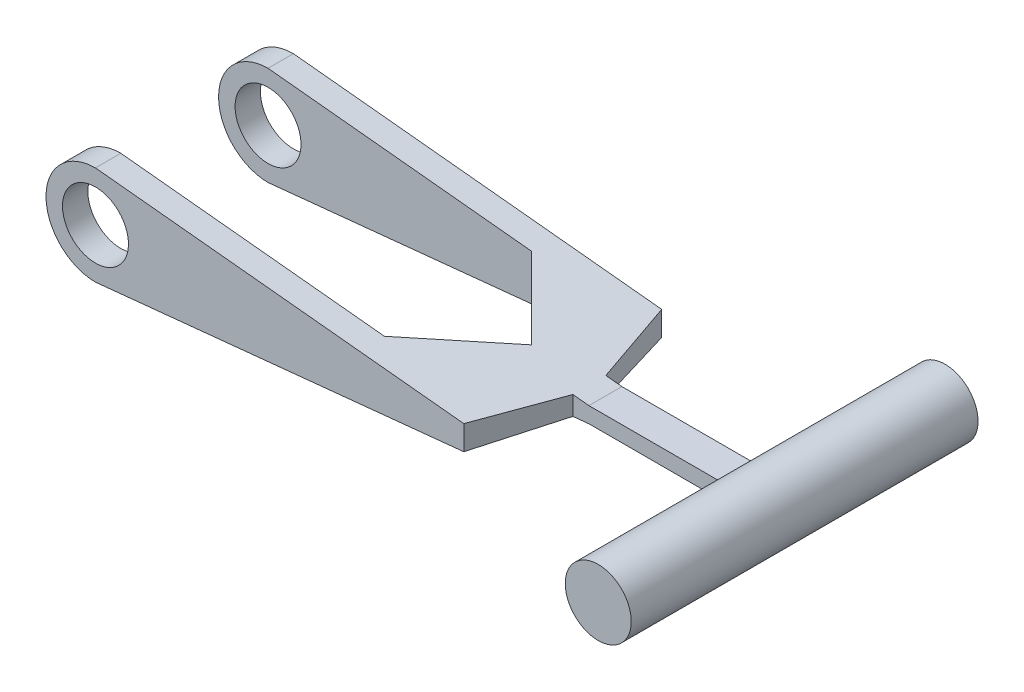
ISO-10303-21;
HEADER;
FILE_DESCRIPTION(('STEP AP214'),'2;1');
FILE_NAME('part.step','',(''),(''),'','','');
FILE_SCHEMA(('AUTOMOTIVE_DESIGN { 1 0 10303 214 1 1 1 1 }'));
ENDSEC;
DATA;
#1=APPLICATION_CONTEXT('core data for automotive mechanical design processes');
#2=APPLICATION_PROTOCOL_DEFINITION('international standard','automotive_design',2000,#1);
#3=PRODUCT_CONTEXT('',#1,'mechanical');
#4=PRODUCT('Part','Part','',(#3));
#5=PRODUCT_RELATED_PRODUCT_CATEGORY('part','',(#4));
#6=PRODUCT_DEFINITION_FORMATION('','',#4);
#7=PRODUCT_DEFINITION_CONTEXT('part definition',#1,'design');
#8=PRODUCT_DEFINITION('design','',#6,#7);
#9=PRODUCT_DEFINITION_SHAPE('','',#8);
#10=(LENGTH_UNIT() NAMED_UNIT(*) SI_UNIT(.MILLI.,.METRE.));
#11=(NAMED_UNIT(*) PLANE_ANGLE_UNIT() SI_UNIT($,.RADIAN.));
#12=(NAMED_UNIT(*) SI_UNIT($,.STERADIAN.) SOLID_ANGLE_UNIT());
#13=UNCERTAINTY_MEASURE_WITH_UNIT(LENGTH_MEASURE(1.E-05),#10,'distance_accuracy_value','');
#14=(GEOMETRIC_REPRESENTATION_CONTEXT(3) GLOBAL_UNCERTAINTY_ASSIGNED_CONTEXT((#13)) GLOBAL_UNIT_ASSIGNED_CONTEXT((#10,
#11,#12)) REPRESENTATION_CONTEXT('',''));
#15=CARTESIAN_POINT('',(0.,0.,0.));
#16=DIRECTION('',(0.,0.,1.));
#17=DIRECTION('',(1.,0.,0.));
#18=AXIS2_PLACEMENT_3D('',#15,#16,#17);
#19=CARTESIAN_POINT('',(0.640803523495961,6.32907244155821,60.));
#20=DIRECTION('',(0.100732627612411,0.994913532792825,0.));
#21=DIRECTION('',(-0.994913532792825,0.100732627612411,0.));
#22=AXIS2_PLACEMENT_3D('',#19,#20,#21);
#23=PLANE('',#22);
#24=DIRECTION('',(0.306978652976379,-0.0310808581007294,0.951208750420501));
#25=VECTOR('',#24,1.);
#26=CARTESIAN_POINT('',(41.7089621890155,2.17101910604021,46.6104218580542));
#27=LINE('',#26,#25);
#28=CARTESIAN_POINT('',(26.6666231542653,3.69402013724908,0.));
#29=VERTEX_POINT('',#28);
#30=CARTESIAN_POINT('',(34.7347431342558,2.87714218887577,25.));
#31=VERTEX_POINT('',#30);
#32=EDGE_CURVE('E282',#29,#31,#27,.T.);
#33=ORIENTED_EDGE('',*,*,#32,.F.);
#34=DIRECTION('',(0.994913532792825,-0.100732627612411,0.));
#35=VECTOR('',#34,1.);
#36=CARTESIAN_POINT('',(0.640803523495961,6.32907244155821,0.));
#37=LINE('',#36,#35);
#38=CARTESIAN_POINT('',(-85.,15.,0.));
#39=VERTEX_POINT('',#38);
#40=EDGE_CURVE('E348',#39,#29,#37,.T.);
#41=ORIENTED_EDGE('',*,*,#40,.F.);
#42=DIRECTION('',(0.,0.,-1.));
#43=VECTOR('',#42,1.);
#44=CARTESIAN_POINT('',(-85.,15.,60.));
#45=LINE('',#44,#43);
#46=CARTESIAN_POINT('',(-85.,15.,7.68377667000001));
#47=VERTEX_POINT('',#46);
#48=EDGE_CURVE('E366',#47,#39,#45,.T.);
#49=ORIENTED_EDGE('',*,*,#48,.F.);
#50=DIRECTION('',(0.994913532792825,-0.100732627612411,0.));
#51=VECTOR('',#50,1.);
#52=CARTESIAN_POINT('',(0.640803523495961,6.32907244155821,7.68377667000001));
#53=LINE('',#52,#51);
#54=CARTESIAN_POINT('',(-5.08697579948381,6.90899646768755,7.68377667000001));
#55=VERTEX_POINT('',#54);
#56=EDGE_CURVE('E324',#47,#55,#53,.T.);
#57=ORIENTED_EDGE('',*,*,#56,.T.);
#58=DIRECTION('',(0.705301565603934,-0.0714101051203874,0.705301565603916));
#59=VECTOR('',#58,1.);
#60=CARTESIAN_POINT('',(23.8162388987994,3.98261476009246,36.5869913682825));
#61=LINE('',#60,#59);
#62=CARTESIAN_POINT('',(17.2292475305167,4.64953196115295,30.));
#63=VERTEX_POINT('',#62);
#64=EDGE_CURVE('E330',#55,#63,#61,.T.);
#65=ORIENTED_EDGE('',*,*,#64,.T.);
#66=DIRECTION('',(-0.705301565603934,0.0714101051203874,0.705301565603916));
#67=VECTOR('',#66,1.);
#68=CARTESIAN_POINT('',(-6.03077900780142,7.00455429657343,53.2600265383176));
#69=LINE('',#68,#67);
#70=CARTESIAN_POINT('',(-5.08697579948381,6.90899646768756,52.31622333));
#71=VERTEX_POINT('',#70);
#72=EDGE_CURVE('E327',#63,#71,#69,.T.);
#73=ORIENTED_EDGE('',*,*,#72,.T.);
#74=DIRECTION('',(-0.994913532792825,0.100732627612411,0.));
#75=VECTOR('',#74,1.);
#76=CARTESIAN_POINT('',(0.64080352349596,6.32907244155821,52.31622333));
#77=LINE('',#76,#75);
#78=CARTESIAN_POINT('',(-85.,15.,52.31622333));
#79=VERTEX_POINT('',#78);
#80=EDGE_CURVE('E316',#71,#79,#77,.T.);
#81=ORIENTED_EDGE('',*,*,#80,.T.);
#82=CARTESIAN_POINT('',(-85.,15.,60.));
#83=VERTEX_POINT('',#82);
#84=EDGE_CURVE('E367',#83,#79,#45,.T.);
#85=ORIENTED_EDGE('',*,*,#84,.F.);
#86=DIRECTION('',(0.994913532792825,-0.100732627612411,0.));
#87=VECTOR('',#86,1.);
#88=CARTESIAN_POINT('',(0.640803523495961,6.32907244155821,60.));
#89=LINE('',#88,#87);
#90=CARTESIAN_POINT('',(26.6666231542653,3.69402013724908,60.));
#91=VERTEX_POINT('',#90);
#92=EDGE_CURVE('E337',#83,#91,#89,.T.);
#93=ORIENTED_EDGE('',*,*,#92,.T.);
#94=DIRECTION('',(0.306978652976379,-0.0310808581007294,-0.951208750420501));
#95=VECTOR('',#94,1.);
#96=CARTESIAN_POINT('',(24.1889153348097,3.94488215779971,67.6774633545376));
#97=LINE('',#96,#95);
#98=CARTESIAN_POINT('',(34.7347431342559,2.87714218887577,35.));
#99=VERTEX_POINT('',#98);
#100=EDGE_CURVE('E121',#91,#99,#97,.T.);
#101=ORIENTED_EDGE('',*,*,#100,.T.);
#102=DIRECTION('',(0.994913532792825,-0.100732627612411,0.));
#103=VECTOR('',#102,1.);
#104=CARTESIAN_POINT('',(0.640803523495965,6.32907244155821,35.));
#105=LINE('',#104,#103);
#106=CARTESIAN_POINT('',(39.5992195470742,2.38462552800949,35.));
#107=VERTEX_POINT('',#106);
#108=EDGE_CURVE('E287',#99,#107,#105,.T.);
#109=ORIENTED_EDGE('',*,*,#108,.T.);
#110=DIRECTION('',(0.,0.,-1.));
#111=VECTOR('',#110,1.);
#112=CARTESIAN_POINT('',(39.5992195470742,2.3846255280095,60.));
#113=LINE('',#112,#111);
#114=CARTESIAN_POINT('',(39.5992195470742,2.38462552800949,25.));
#115=VERTEX_POINT('',#114);
#116=EDGE_CURVE('E236',#107,#115,#113,.T.);
#117=ORIENTED_EDGE('',*,*,#116,.T.);
#118=DIRECTION('',(0.994913532792825,-0.100732627612411,0.));
#119=VECTOR('',#118,1.);
#120=CARTESIAN_POINT('',(0.640803523495961,6.32907244155821,25.));
#121=LINE('',#120,#119);
#122=EDGE_CURVE('E300',#31,#115,#121,.T.);
#123=ORIENTED_EDGE('',*,*,#122,.F.);
#124=EDGE_LOOP('',(#33,#41,#49,#57,#65,#73,#81,#85,#93,#101,#109,#117,#123));
#125=FACE_BOUND('',#124,.T.);
#126=ADVANCED_FACE('F99',(#125),#23,.T.);
#127=CARTESIAN_POINT('',(-85.,0.,60.));
#128=DIRECTION('',(0.,0.,-1.));
#129=DIRECTION('',(-1.,0.,0.));
#130=AXIS2_PLACEMENT_3D('',#127,#128,#129);
#131=CYLINDRICAL_SURFACE('',#130,15.);
#132=CARTESIAN_POINT('',(-85.,0.,7.68377667000001));
#133=DIRECTION('',(0.,0.,1.));
#134=DIRECTION('',(1.,0.,0.));
#135=AXIS2_PLACEMENT_3D('',#132,#133,#134);
#136=CIRCLE('',#135,15.);
#137=CARTESIAN_POINT('',(-85.,-15.,7.68377667000001));
#138=VERTEX_POINT('',#137);
#139=EDGE_CURVE('E322',#47,#138,#136,.T.);
#140=ORIENTED_EDGE('',*,*,#139,.F.);
#141=ORIENTED_EDGE('',*,*,#48,.T.);
#142=CARTESIAN_POINT('',(-85.,0.,0.));
#143=DIRECTION('',(0.,0.,1.));
#144=DIRECTION('',(1.,0.,0.));
#145=AXIS2_PLACEMENT_3D('',#142,#143,#144);
#146=CIRCLE('',#145,15.);
#147=CARTESIAN_POINT('',(-85.,-15.,0.));
#148=VERTEX_POINT('',#147);
#149=EDGE_CURVE('E351',#39,#148,#146,.T.);
#150=ORIENTED_EDGE('',*,*,#149,.T.);
#151=DIRECTION('',(0.,0.,-1.));
#152=VECTOR('',#151,1.);
#153=CARTESIAN_POINT('',(-85.,-15.,60.));
#154=LINE('',#153,#152);
#155=EDGE_CURVE('E362',#138,#148,#154,.T.);
#156=ORIENTED_EDGE('',*,*,#155,.F.);
#157=EDGE_LOOP('',(#140,#141,#150,#156));
#158=FACE_BOUND('',#157,.T.);
#159=ADVANCED_FACE('F411',(#158),#131,.T.);
#160=CARTESIAN_POINT('',(-85.,-15.,60.));
#161=VERTEX_POINT('',#160);
#162=CARTESIAN_POINT('',(-85.,-15.,52.31622333));
#163=VERTEX_POINT('',#162);
#164=EDGE_CURVE('E363',#161,#163,#154,.T.);
#165=ORIENTED_EDGE('',*,*,#164,.F.);
#166=CARTESIAN_POINT('',(-85.,0.,60.));
#167=DIRECTION('',(0.,0.,1.));
#168=DIRECTION('',(1.,0.,0.));
#169=AXIS2_PLACEMENT_3D('',#166,#167,#168);
#170=CIRCLE('',#169,15.);
#171=EDGE_CURVE('E341',#83,#161,#170,.T.);
#172=ORIENTED_EDGE('',*,*,#171,.F.);
#173=ORIENTED_EDGE('',*,*,#84,.T.);
#174=CARTESIAN_POINT('',(-85.,0.,52.31622333));
#175=DIRECTION('',(0.,0.,-1.));
#176=DIRECTION('',(-1.,0.,0.));
#177=AXIS2_PLACEMENT_3D('',#174,#175,#176);
#178=CIRCLE('',#177,15.);
#179=EDGE_CURVE('E314',#163,#79,#178,.T.);
#180=ORIENTED_EDGE('',*,*,#179,.F.);
#181=EDGE_LOOP('',(#165,#172,#173,#180));
#182=FACE_BOUND('',#181,.T.);
#183=ADVANCED_FACE('F397',(#182),#131,.T.);
#184=CARTESIAN_POINT('',(0.640803523495961,-6.32907244155821,60.));
#185=DIRECTION('',(-0.100732627612411,0.994913532792825,0.));
#186=DIRECTION('',(-0.994913532792825,-0.100732627612411,0.));
#187=AXIS2_PLACEMENT_3D('',#184,#185,#186);
#188=PLANE('',#187);
#189=DIRECTION('',(0.994913532792825,0.100732627612411,0.));
#190=VECTOR('',#189,1.);
#191=CARTESIAN_POINT('',(0.640803523495961,-6.32907244155821,0.));
#192=LINE('',#191,#190);
#193=CARTESIAN_POINT('',(26.6666231542653,-3.69402013724908,0.));
#194=VERTEX_POINT('',#193);
#195=EDGE_CURVE('E338',#148,#194,#192,.T.);
#196=ORIENTED_EDGE('',*,*,#195,.T.);
#197=DIRECTION('',(0.306978652976379,0.0310808581007294,0.951208750420501));
#198=VECTOR('',#197,1.);
#199=CARTESIAN_POINT('',(41.7089621890155,-2.17101910604021,46.6104218580542));
#200=LINE('',#199,#198);
#201=CARTESIAN_POINT('',(34.7347431342558,-2.87714218887577,25.));
#202=VERTEX_POINT('',#201);
#203=EDGE_CURVE('E264',#194,#202,#200,.T.);
#204=ORIENTED_EDGE('',*,*,#203,.T.);
#205=DIRECTION('',(0.994913532792825,0.100732627612411,0.));
#206=VECTOR('',#205,1.);
#207=CARTESIAN_POINT('',(0.640803523495961,-6.32907244155821,25.));
#208=LINE('',#207,#206);
#209=CARTESIAN_POINT('',(39.5992195470742,-2.3846255280095,25.));
#210=VERTEX_POINT('',#209);
#211=EDGE_CURVE('E307',#202,#210,#208,.T.);
#212=ORIENTED_EDGE('',*,*,#211,.T.);
#213=DIRECTION('',(0.,0.,-1.));
#214=VECTOR('',#213,1.);
#215=CARTESIAN_POINT('',(39.5992195470742,-2.38462552800949,60.));
#216=LINE('',#215,#214);
#217=CARTESIAN_POINT('',(39.5992195470742,-2.3846255280095,35.));
#218=VERTEX_POINT('',#217);
#219=EDGE_CURVE('E359',#218,#210,#216,.T.);
#220=ORIENTED_EDGE('',*,*,#219,.F.);
#221=DIRECTION('',(0.994913532792825,0.100732627612411,0.));
#222=VECTOR('',#221,1.);
#223=CARTESIAN_POINT('',(0.640803523495965,-6.32907244155821,35.));
#224=LINE('',#223,#222);
#225=CARTESIAN_POINT('',(34.7347431342559,-2.87714218887577,35.));
#226=VERTEX_POINT('',#225);
#227=EDGE_CURVE('E294',#226,#218,#224,.T.);
#228=ORIENTED_EDGE('',*,*,#227,.F.);
#229=DIRECTION('',(0.306978652976379,0.0310808581007294,-0.951208750420501));
#230=VECTOR('',#229,1.);
#231=CARTESIAN_POINT('',(24.1889153348097,-3.94488215779971,67.6774633545376));
#232=LINE('',#231,#230);
#233=CARTESIAN_POINT('',(26.6666231542653,-3.69402013724908,60.));
#234=VERTEX_POINT('',#233);
#235=EDGE_CURVE('E284',#234,#226,#232,.T.);
#236=ORIENTED_EDGE('',*,*,#235,.F.);
#237=DIRECTION('',(0.994913532792825,0.100732627612411,0.));
#238=VECTOR('',#237,1.);
#239=CARTESIAN_POINT('',(0.640803523495961,-6.32907244155821,60.));
#240=LINE('',#239,#238);
#241=EDGE_CURVE('E343',#161,#234,#240,.T.);
#242=ORIENTED_EDGE('',*,*,#241,.F.);
#243=ORIENTED_EDGE('',*,*,#164,.T.);
#244=DIRECTION('',(-0.994913532792825,-0.100732627612411,0.));
#245=VECTOR('',#244,1.);
#246=CARTESIAN_POINT('',(0.64080352349596,-6.32907244155821,52.31622333));
#247=LINE('',#246,#245);
#248=CARTESIAN_POINT('',(-5.08697579948381,-6.90899646768755,52.31622333));
#249=VERTEX_POINT('',#248);
#250=EDGE_CURVE('E311',#249,#163,#247,.T.);
#251=ORIENTED_EDGE('',*,*,#250,.F.);
#252=DIRECTION('',(-0.705301565603934,-0.0714101051203874,0.705301565603916));
#253=VECTOR('',#252,1.);
#254=CARTESIAN_POINT('',(-6.03077900780142,-7.00455429657343,53.2600265383176));
#255=LINE('',#254,#253);
#256=CARTESIAN_POINT('',(17.2292475305167,-4.64953196115294,30.));
#257=VERTEX_POINT('',#256);
#258=EDGE_CURVE('E107',#257,#249,#255,.T.);
#259=ORIENTED_EDGE('',*,*,#258,.F.);
#260=DIRECTION('',(0.705301565603934,0.0714101051203874,0.705301565603916));
#261=VECTOR('',#260,1.);
#262=CARTESIAN_POINT('',(23.8162388987994,-3.98261476009246,36.5869913682825));
#263=LINE('',#262,#261);
#264=CARTESIAN_POINT('',(-5.08697579948381,-6.90899646768756,7.68377667000001));
#265=VERTEX_POINT('',#264);
#266=EDGE_CURVE('E13',#265,#257,#263,.T.);
#267=ORIENTED_EDGE('',*,*,#266,.F.);
#268=DIRECTION('',(0.994913532792825,0.100732627612411,0.));
#269=VECTOR('',#268,1.);
#270=CARTESIAN_POINT('',(0.640803523495961,-6.32907244155821,7.68377667000001));
#271=LINE('',#270,#269);
#272=EDGE_CURVE('E320',#138,#265,#271,.T.);
#273=ORIENTED_EDGE('',*,*,#272,.F.);
#274=ORIENTED_EDGE('',*,*,#155,.T.);
#275=EDGE_LOOP('',(#196,#204,#212,#220,#228,#236,#242,#243,#251,#259,#267,#273,#274));
#276=FACE_BOUND('',#275,.T.);
#277=ADVANCED_FACE('F391',(#276),#188,.F.);
#278=CARTESIAN_POINT('',(0.,-2.3846255280095,60.));
#279=DIRECTION('',(0.,1.,0.));
#280=DIRECTION('',(0.,0.,1.));
#281=AXIS2_PLACEMENT_3D('',#278,#279,#280);
#282=PLANE('',#281);
#283=ORIENTED_EDGE('',*,*,#219,.T.);
#284=DIRECTION('',(1.,0.,0.));
#285=VECTOR('',#284,1.);
#286=CARTESIAN_POINT('',(0.,-2.3846255280095,25.));
#287=LINE('',#286,#285);
#288=CARTESIAN_POINT('',(80.2152215636175,-2.3846255280095,25.));
#289=VERTEX_POINT('',#288);
#290=EDGE_CURVE('E304',#210,#289,#287,.T.);
#291=ORIENTED_EDGE('',*,*,#290,.T.);
#292=DIRECTION('',(0.,0.,-1.));
#293=VECTOR('',#292,1.);
#294=CARTESIAN_POINT('',(80.2152215636175,-2.3846255280095,60.));
#295=LINE('',#294,#293);
#296=CARTESIAN_POINT('',(80.2152215636175,-2.3846255280095,35.));
#297=VERTEX_POINT('',#296);
#298=EDGE_CURVE('E357',#297,#289,#295,.T.);
#299=ORIENTED_EDGE('',*,*,#298,.F.);
#300=DIRECTION('',(1.,0.,0.));
#301=VECTOR('',#300,1.);
#302=CARTESIAN_POINT('',(0.,-2.3846255280095,35.));
#303=LINE('',#302,#301);
#304=EDGE_CURVE('E292',#218,#297,#303,.T.);
#305=ORIENTED_EDGE('',*,*,#304,.F.);
#306=EDGE_LOOP('',(#283,#291,#299,#305));
#307=FACE_BOUND('',#306,.T.);
#308=ADVANCED_FACE('F428',(#307),#282,.F.);
#309=CARTESIAN_POINT('',(-85.,0.,60.));
#310=DIRECTION('',(0.,0.,-1.));
#311=DIRECTION('',(-1.,0.,0.));
#312=AXIS2_PLACEMENT_3D('',#309,#310,#311);
#313=CYLINDRICAL_SURFACE('',#312,9.99999999999999);
#314=CARTESIAN_POINT('',(-85.,0.,0.));
#315=DIRECTION('',(0.,0.,1.));
#316=DIRECTION('',(1.,0.,0.));
#317=AXIS2_PLACEMENT_3D('',#314,#315,#316);
#318=CIRCLE('',#317,9.99999999999999);
#319=CARTESIAN_POINT('',(-95.,0.,0.));
#320=VERTEX_POINT('',#319);
#321=EDGE_CURVE('E333',#320,#320,#318,.T.);
#322=CARTESIAN_POINT('',(-85.,0.,7.68377667000001));
#323=DIRECTION('',(0.,0.,1.));
#324=DIRECTION('',(1.,0.,0.));
#325=AXIS2_PLACEMENT_3D('',#322,#323,#324);
#326=CIRCLE('',#325,9.99999999999999);
#327=CARTESIAN_POINT('',(-95.,0.,7.68377667));
#328=VERTEX_POINT('',#327);
#329=EDGE_CURVE('E319',#328,#328,#326,.T.);
#330=CARTESIAN_POINT('',(-95.,0.,0.));
#331=CARTESIAN_POINT('',(-95.,0.,0.0800393403124997));
#332=CARTESIAN_POINT('',(-95.,0.,0.160078680624999));
#333=CARTESIAN_POINT('',(-95.,0.,0.320157361249999));
#334=CARTESIAN_POINT('',(-95.,0.,0.400196701562499));
#335=CARTESIAN_POINT('',(-95.,0.,0.560275382187498));
#336=CARTESIAN_POINT('',(-95.,0.,0.640314722499998));
#337=CARTESIAN_POINT('',(-95.,0.,0.800393403124997));
#338=CARTESIAN_POINT('',(-95.,0.,0.880432743437497));
#339=CARTESIAN_POINT('',(-95.,0.,1.0405114240625));
#340=CARTESIAN_POINT('',(-95.,0.,1.120550764375));
#341=CARTESIAN_POINT('',(-95.,0.,1.280629445));
#342=CARTESIAN_POINT('',(-95.,0.,1.3606687853125));
#343=CARTESIAN_POINT('',(-95.,0.,1.5207474659375));
#344=CARTESIAN_POINT('',(-95.,0.,1.60078680625));
#345=CARTESIAN_POINT('',(-95.,0.,1.760865486875));
#346=CARTESIAN_POINT('',(-95.,0.,1.8409048271875));
#347=CARTESIAN_POINT('',(-95.,0.,2.0009835078125));
#348=CARTESIAN_POINT('',(-95.,0.,2.081022848125));
#349=CARTESIAN_POINT('',(-95.,0.,2.24110152875));
#350=CARTESIAN_POINT('',(-95.,0.,2.3211408690625));
#351=CARTESIAN_POINT('',(-95.,0.,2.4812195496875));
#352=CARTESIAN_POINT('',(-95.,0.,2.56125889));
#353=CARTESIAN_POINT('',(-95.,0.,2.721337570625));
#354=CARTESIAN_POINT('',(-95.,0.,2.8013769109375));
#355=CARTESIAN_POINT('',(-95.,0.,2.9614555915625));
#356=CARTESIAN_POINT('',(-95.,0.,3.041494931875));
#357=CARTESIAN_POINT('',(-95.,0.,3.2015736125));
#358=CARTESIAN_POINT('',(-95.,0.,3.2816129528125));
#359=CARTESIAN_POINT('',(-95.,0.,3.4416916334375));
#360=CARTESIAN_POINT('',(-95.,0.,3.52173097375));
#361=CARTESIAN_POINT('',(-95.,0.,3.681809654375));
#362=CARTESIAN_POINT('',(-95.,0.,3.7618489946875));
#363=CARTESIAN_POINT('',(-95.,0.,3.9219276753125));
#364=CARTESIAN_POINT('',(-95.,0.,4.001967015625));
#365=CARTESIAN_POINT('',(-95.,0.,4.16204569625));
#366=CARTESIAN_POINT('',(-95.,0.,4.2420850365625));
#367=CARTESIAN_POINT('',(-95.,0.,4.4021637171875));
#368=CARTESIAN_POINT('',(-95.,0.,4.4822030575));
#369=CARTESIAN_POINT('',(-95.,0.,4.642281738125));
#370=CARTESIAN_POINT('',(-95.,0.,4.7223210784375));
#371=CARTESIAN_POINT('',(-95.,0.,4.8823997590625));
#372=CARTESIAN_POINT('',(-95.,0.,4.962439099375));
#373=CARTESIAN_POINT('',(-95.,0.,5.12251778));
#374=CARTESIAN_POINT('',(-95.,0.,5.2025571203125));
#375=CARTESIAN_POINT('',(-95.,0.,5.3626358009375));
#376=CARTESIAN_POINT('',(-95.,0.,5.44267514125));
#377=CARTESIAN_POINT('',(-95.,0.,5.602753821875));
#378=CARTESIAN_POINT('',(-95.,0.,5.6827931621875));
#379=CARTESIAN_POINT('',(-95.,0.,5.8428718428125));
#380=CARTESIAN_POINT('',(-95.,0.,5.922911183125));
#381=CARTESIAN_POINT('',(-95.,0.,6.08298986375));
#382=CARTESIAN_POINT('',(-95.,0.,6.1630292040625));
#383=CARTESIAN_POINT('',(-95.,0.,6.3231078846875));
#384=CARTESIAN_POINT('',(-95.,0.,6.403147225));
#385=CARTESIAN_POINT('',(-95.,0.,6.563225905625));
#386=CARTESIAN_POINT('',(-95.,0.,6.6432652459375));
#387=CARTESIAN_POINT('',(-95.,0.,6.80334392656251));
#388=CARTESIAN_POINT('',(-95.,0.,6.88338326687501));
#389=CARTESIAN_POINT('',(-95.,0.,7.04346194750001));
#390=CARTESIAN_POINT('',(-95.,0.,7.1235012878125));
#391=CARTESIAN_POINT('',(-95.,0.,7.2835799684375));
#392=CARTESIAN_POINT('',(-95.,0.,7.36361930875));
#393=CARTESIAN_POINT('',(-95.,0.,7.523697989375));
#394=CARTESIAN_POINT('',(-95.,0.,7.6037373296875));
#395=CARTESIAN_POINT('',(-95.,0.,7.68377667));
#396=B_SPLINE_CURVE_WITH_KNOTS('',3,(#330,#331,#332,#333,#334,#335,#336,#337,#338,#339,#340,
#341,#342,#343,#344,#345,#346,#347,#348,#349,#350,#351,#352,#353,#354,#355,#356,#357,#358,#359,
#360,#361,#362,#363,#364,#365,#366,#367,#368,#369,#370,#371,#372,#373,#374,#375,#376,#377,#378,
#379,#380,#381,#382,#383,#384,#385,#386,#387,#388,#389,#390,#391,#392,#393,#394,#395),
.UNSPECIFIED.,.F.,.F.,(4,2,2,2,2,2,2,2,2,2,2,2,2,2,2,2,2,2,2,2,2,2,2,2,2,2,2,2,2,2,2,2,4),(0.,
0.240118020937499,0.480236041874998,0.720354062812498,0.960472083749997,1.2005901046875,
1.440708125625,1.6808261465625,1.9209441675,2.1610621884375,2.401180209375,2.6412982303125,
2.88141625125,3.1215342721875,3.361652293125,3.6017703140625,3.841888335,4.0820063559375,
4.322124376875,4.5622423978125,4.80236041875,5.04247843968751,5.282596460625,5.5227144815625,
5.7628325025,6.0029505234375,6.243068544375,6.4831865653125,6.72330458625001,6.96342260718751,
7.203540628125,7.4436586490625,7.68377667),.UNSPECIFIED.);
#397=EDGE_CURVE('BSEAM101',#320,#328,#396,.T.);
#398=ORIENTED_EDGE('',*,*,#321,.F.);
#399=ORIENTED_EDGE('',*,*,#329,.T.);
#400=ORIENTED_EDGE('',*,*,#397,.T.);
#401=ORIENTED_EDGE('',*,*,#397,.F.);
#402=EDGE_LOOP('',(#398,#400,#399,#401));
#403=FACE_BOUND('',#402,.T.);
#404=ADVANCED_FACE('F101',(#403),#313,.F.);
#405=CARTESIAN_POINT('',(-85.,0.,60.));
#406=DIRECTION('',(0.,0.,1.));
#407=DIRECTION('',(1.,0.,0.));
#408=AXIS2_PLACEMENT_3D('',#405,#406,#407);
#409=CIRCLE('',#408,9.99999999999999);
#410=CARTESIAN_POINT('',(-95.,0.,60.));
#411=VERTEX_POINT('',#410);
#412=EDGE_CURVE('E334',#411,#411,#409,.T.);
#413=CARTESIAN_POINT('',(-85.,0.,52.31622333));
#414=DIRECTION('',(0.,0.,-1.));
#415=DIRECTION('',(-1.,0.,0.));
#416=AXIS2_PLACEMENT_3D('',#413,#414,#415);
#417=CIRCLE('',#416,9.99999999999999);
#418=CARTESIAN_POINT('',(-95.,0.,52.31622333));
#419=VERTEX_POINT('',#418);
#420=EDGE_CURVE('E310',#419,#419,#417,.T.);
#421=CARTESIAN_POINT('',(-95.,0.,60.));
#422=CARTESIAN_POINT('',(-95.,0.,59.9199606596875));
#423=CARTESIAN_POINT('',(-95.,0.,59.839921319375));
#424=CARTESIAN_POINT('',(-95.,0.,59.67984263875));
#425=CARTESIAN_POINT('',(-95.,0.,59.5998032984375));
#426=CARTESIAN_POINT('',(-95.,0.,59.4397246178125));
#427=CARTESIAN_POINT('',(-95.,0.,59.3596852775));
#428=CARTESIAN_POINT('',(-95.,0.,59.199606596875));
#429=CARTESIAN_POINT('',(-95.,0.,59.1195672565625));
#430=CARTESIAN_POINT('',(-95.,0.,58.9594885759375));
#431=CARTESIAN_POINT('',(-95.,0.,58.879449235625));
#432=CARTESIAN_POINT('',(-95.,0.,58.719370555));
#433=CARTESIAN_POINT('',(-95.,0.,58.6393312146875));
#434=CARTESIAN_POINT('',(-95.,0.,58.4792525340625));
#435=CARTESIAN_POINT('',(-95.,0.,58.39921319375));
#436=CARTESIAN_POINT('',(-95.,0.,58.239134513125));
#437=CARTESIAN_POINT('',(-95.,0.,58.1590951728125));
#438=CARTESIAN_POINT('',(-95.,0.,57.9990164921875));
#439=CARTESIAN_POINT('',(-95.,0.,57.918977151875));
#440=CARTESIAN_POINT('',(-95.,0.,57.75889847125));
#441=CARTESIAN_POINT('',(-95.,0.,57.6788591309375));
#442=CARTESIAN_POINT('',(-95.,0.,57.5187804503125));
#443=CARTESIAN_POINT('',(-95.,0.,57.43874111));
#444=CARTESIAN_POINT('',(-95.,0.,57.278662429375));
#445=CARTESIAN_POINT('',(-95.,0.,57.1986230890625));
#446=CARTESIAN_POINT('',(-95.,0.,57.0385444084375));
#447=CARTESIAN_POINT('',(-95.,0.,56.958505068125));
#448=CARTESIAN_POINT('',(-95.,0.,56.7984263875));
#449=CARTESIAN_POINT('',(-95.,0.,56.7183870471875));
#450=CARTESIAN_POINT('',(-95.,0.,56.5583083665625));
#451=CARTESIAN_POINT('',(-95.,0.,56.47826902625));
#452=CARTESIAN_POINT('',(-95.,0.,56.318190345625));
#453=CARTESIAN_POINT('',(-95.,0.,56.2381510053125));
#454=CARTESIAN_POINT('',(-95.,0.,56.0780723246875));
#455=CARTESIAN_POINT('',(-95.,0.,55.998032984375));
#456=CARTESIAN_POINT('',(-95.,0.,55.83795430375));
#457=CARTESIAN_POINT('',(-95.,0.,55.7579149634375));
#458=CARTESIAN_POINT('',(-95.,0.,55.5978362828125));
#459=CARTESIAN_POINT('',(-95.,0.,55.5177969425));
#460=CARTESIAN_POINT('',(-95.,0.,55.357718261875));
#461=CARTESIAN_POINT('',(-95.,0.,55.2776789215625));
#462=CARTESIAN_POINT('',(-95.,0.,55.1176002409375));
#463=CARTESIAN_POINT('',(-95.,0.,55.037560900625));
#464=CARTESIAN_POINT('',(-95.,0.,54.87748222));
#465=CARTESIAN_POINT('',(-95.,0.,54.7974428796875));
#466=CARTESIAN_POINT('',(-95.,0.,54.6373641990625));
#467=CARTESIAN_POINT('',(-95.,0.,54.55732485875));
#468=CARTESIAN_POINT('',(-95.,0.,54.397246178125));
#469=CARTESIAN_POINT('',(-95.,0.,54.3172068378125));
#470=CARTESIAN_POINT('',(-95.,0.,54.1571281571875));
#471=CARTESIAN_POINT('',(-95.,0.,54.077088816875));
#472=CARTESIAN_POINT('',(-95.,0.,53.91701013625));
#473=CARTESIAN_POINT('',(-95.,0.,53.8369707959375));
#474=CARTESIAN_POINT('',(-95.,0.,53.6768921153125));
#475=CARTESIAN_POINT('',(-95.,0.,53.596852775));
#476=CARTESIAN_POINT('',(-95.,0.,53.436774094375));
#477=CARTESIAN_POINT('',(-95.,0.,53.3567347540625));
#478=CARTESIAN_POINT('',(-95.,0.,53.1966560734375));
#479=CARTESIAN_POINT('',(-95.,0.,53.116616733125));
#480=CARTESIAN_POINT('',(-95.,0.,52.9565380525));
#481=CARTESIAN_POINT('',(-95.,0.,52.8764987121875));
#482=CARTESIAN_POINT('',(-95.,0.,52.7164200315625));
#483=CARTESIAN_POINT('',(-95.,0.,52.63638069125));
#484=CARTESIAN_POINT('',(-95.,0.,52.476302010625));
#485=CARTESIAN_POINT('',(-95.,0.,52.3962626703125));
#486=CARTESIAN_POINT('',(-95.,0.,52.31622333));
#487=B_SPLINE_CURVE_WITH_KNOTS('',3,(#421,#422,#423,#424,#425,#426,#427,#428,#429,#430,#431,
#432,#433,#434,#435,#436,#437,#438,#439,#440,#441,#442,#443,#444,#445,#446,#447,#448,#449,#450,
#451,#452,#453,#454,#455,#456,#457,#458,#459,#460,#461,#462,#463,#464,#465,#466,#467,#468,#469,
#470,#471,#472,#473,#474,#475,#476,#477,#478,#479,#480,#481,#482,#483,#484,#485,#486),
.UNSPECIFIED.,.F.,.F.,(4,2,2,2,2,2,2,2,2,2,2,2,2,2,2,2,2,2,2,2,2,2,2,2,2,2,2,2,2,2,2,2,4),(0.,
0.240118020937492,0.480236041874992,0.720354062812491,0.96047208374999,1.20059010468749,
1.44070812562499,1.68082614656249,1.92094416749999,2.16106218843749,2.40118020937499,
2.64129823031248,2.88141625124998,3.12153427218748,3.36165229312498,3.60177031406248,
3.84188833499998,4.08200635593748,4.32212437687498,4.56224239781248,4.80236041874998,
5.04247843968748,5.28259646062498,5.52271448156248,5.76283250249997,6.00295052343747,
6.24306854437497,6.48318656531247,6.72330458624997,6.96342260718747,7.20354062812497,
7.44365864906247,7.68377666999997),.UNSPECIFIED.);
#488=EDGE_CURVE('BSEAM453',#411,#419,#487,.T.);
#489=ORIENTED_EDGE('',*,*,#412,.T.);
#490=ORIENTED_EDGE('',*,*,#420,.T.);
#491=ORIENTED_EDGE('',*,*,#488,.T.);
#492=ORIENTED_EDGE('',*,*,#488,.F.);
#493=EDGE_LOOP('',(#489,#491,#490,#492));
#494=FACE_BOUND('',#493,.T.);
#495=ADVANCED_FACE('F453',(#494),#313,.F.);
#496=CARTESIAN_POINT('',(0.,2.38462552800949,60.));
#497=DIRECTION('',(0.,1.,0.));
#498=DIRECTION('',(0.,0.,1.));
#499=AXIS2_PLACEMENT_3D('',#496,#497,#498);
#500=PLANE('',#499);
#501=DIRECTION('',(1.,0.,0.));
#502=VECTOR('',#501,1.);
#503=CARTESIAN_POINT('',(0.,2.38462552800949,25.));
#504=LINE('',#503,#502);
#505=CARTESIAN_POINT('',(80.3730059510737,2.3846255280095,25.));
#506=VERTEX_POINT('',#505);
#507=EDGE_CURVE('E378',#115,#506,#504,.T.);
#508=ORIENTED_EDGE('',*,*,#507,.F.);
#509=ORIENTED_EDGE('',*,*,#116,.F.);
#510=DIRECTION('',(1.,0.,0.));
#511=VECTOR('',#510,1.);
#512=CARTESIAN_POINT('',(0.,2.38462552800949,35.));
#513=LINE('',#512,#511);
#514=CARTESIAN_POINT('',(80.3730059510737,2.3846255280095,35.));
#515=VERTEX_POINT('',#514);
#516=EDGE_CURVE('E375',#107,#515,#513,.T.);
#517=ORIENTED_EDGE('',*,*,#516,.T.);
#518=DIRECTION('',(0.,0.,-1.));
#519=VECTOR('',#518,1.);
#520=CARTESIAN_POINT('',(80.3730059510737,2.38462552800949,60.));
#521=LINE('',#520,#519);
#522=EDGE_CURVE('E235',#515,#506,#521,.T.);
#523=ORIENTED_EDGE('',*,*,#522,.T.);
#524=EDGE_LOOP('',(#508,#509,#517,#523));
#525=FACE_BOUND('',#524,.T.);
#526=ADVANCED_FACE('F441',(#525),#500,.T.);
#527=CARTESIAN_POINT('',(0.,0.,60.));
#528=DIRECTION('',(0.,0.,1.));
#529=DIRECTION('',(1.,0.,0.));
#530=AXIS2_PLACEMENT_3D('',#527,#528,#529);
#531=PLANE('',#530);
#532=ORIENTED_EDGE('',*,*,#412,.F.);
#533=EDGE_LOOP('',(#532));
#534=FACE_BOUND('',#533,.T.);
#535=ORIENTED_EDGE('',*,*,#241,.T.);
#536=DIRECTION('',(0.,1.,0.));
#537=VECTOR('',#536,1.);
#538=CARTESIAN_POINT('',(26.6666231542653,0.,60.));
#539=LINE('',#538,#537);
#540=EDGE_CURVE('E373',#234,#91,#539,.T.);
#541=ORIENTED_EDGE('',*,*,#540,.T.);
#542=ORIENTED_EDGE('',*,*,#92,.F.);
#543=ORIENTED_EDGE('',*,*,#171,.T.);
#544=EDGE_LOOP('',(#535,#541,#542,#543));
#545=FACE_BOUND('',#544,.T.);
#546=ADVANCED_FACE('F444',(#534,#545),#531,.T.);
#547=CARTESIAN_POINT('',(90.,-0.321106458336584,60.));
#548=DIRECTION('',(0.,0.,-1.));
#549=DIRECTION('',(-1.,0.,0.));
#550=AXIS2_PLACEMENT_3D('',#547,#548,#549);
#551=CYLINDRICAL_SURFACE('',#550,9.99999999999999);
#552=ORIENTED_EDGE('',*,*,#298,.T.);
#553=CARTESIAN_POINT('',(90.,-0.321106458336584,25.));
#554=DIRECTION('',(0.,0.,1.));
#555=DIRECTION('',(1.,0.,0.));
#556=AXIS2_PLACEMENT_3D('',#553,#554,#555);
#557=CIRCLE('',#556,9.99999999999999);
#558=CARTESIAN_POINT('',(80.3730059510737,-3.02683844468266,25.));
#559=VERTEX_POINT('',#558);
#560=EDGE_CURVE('E302',#289,#559,#557,.T.);
#561=ORIENTED_EDGE('',*,*,#560,.T.);
#562=DIRECTION('',(0.,0.,-1.));
#563=VECTOR('',#562,1.);
#564=CARTESIAN_POINT('',(80.3730059510737,-3.02683844468266,60.));
#565=LINE('',#564,#563);
#566=CARTESIAN_POINT('',(80.3730059510737,-3.02683844468266,3.71255940000001));
#567=VERTEX_POINT('',#566);
#568=EDGE_CURVE('E249',#559,#567,#565,.T.);
#569=ORIENTED_EDGE('',*,*,#568,.T.);
#570=CARTESIAN_POINT('',(90.,-0.321106458336584,3.71255940000001));
#571=DIRECTION('',(0.,0.,-1.));
#572=DIRECTION('',(-1.,0.,0.));
#573=AXIS2_PLACEMENT_3D('',#570,#571,#572);
#574=CIRCLE('',#573,9.99999999999999);
#575=CARTESIAN_POINT('',(80.3730059510737,2.38462552800949,3.71255940000001));
#576=VERTEX_POINT('',#575);
#577=EDGE_CURVE('E242',#567,#576,#574,.T.);
#578=ORIENTED_EDGE('',*,*,#577,.T.);
#579=EDGE_CURVE('E224',#506,#576,#521,.T.);
#580=ORIENTED_EDGE('',*,*,#579,.F.);
#581=ORIENTED_EDGE('',*,*,#522,.F.);
#582=CARTESIAN_POINT('',(80.3730059510737,2.3846255280095,56.2874406));
#583=VERTEX_POINT('',#582);
#584=EDGE_CURVE('E238',#583,#515,#521,.T.);
#585=ORIENTED_EDGE('',*,*,#584,.F.);
#586=CARTESIAN_POINT('',(90.,-0.321106458336584,56.2874406));
#587=DIRECTION('',(0.,0.,1.));
#588=DIRECTION('',(1.,0.,0.));
#589=AXIS2_PLACEMENT_3D('',#586,#587,#588);
#590=CIRCLE('',#589,9.99999999999999);
#591=CARTESIAN_POINT('',(80.3730059510737,-3.02683844468266,56.2874406));
#592=VERTEX_POINT('',#591);
#593=EDGE_CURVE('E253',#583,#592,#590,.T.);
#594=ORIENTED_EDGE('',*,*,#593,.T.);
#595=DIRECTION('',(0.,0.,-1.));
#596=VECTOR('',#595,1.);
#597=CARTESIAN_POINT('',(80.3730059510737,-3.02683844468266,60.));
#598=LINE('',#597,#596);
#599=CARTESIAN_POINT('',(80.3730059510737,-3.02683844468266,35.));
#600=VERTEX_POINT('',#599);
#601=EDGE_CURVE('E296',#592,#600,#598,.T.);
#602=ORIENTED_EDGE('',*,*,#601,.T.);
#603=CARTESIAN_POINT('',(90.,-0.321106458336584,35.));
#604=DIRECTION('',(0.,0.,1.));
#605=DIRECTION('',(1.,0.,0.));
#606=AXIS2_PLACEMENT_3D('',#603,#604,#605);
#607=CIRCLE('',#606,9.99999999999999);
#608=EDGE_CURVE('E290',#297,#600,#607,.T.);
#609=ORIENTED_EDGE('',*,*,#608,.F.);
#610=EDGE_LOOP('',(#552,#561,#569,#578,#580,#581,#585,#594,#602,#609));
#611=FACE_BOUND('',#610,.T.);
#612=CARTESIAN_POINT('',(90.,-0.321106458336584,82.5748812));
#613=DIRECTION('',(0.,0.,1.));
#614=DIRECTION('',(1.,0.,0.));
#615=AXIS2_PLACEMENT_3D('',#612,#613,#614);
#616=CIRCLE('',#615,9.99999999999999);
#617=CARTESIAN_POINT('',(100.,-0.321106458336584,82.5748812));
#618=VERTEX_POINT('',#617);
#619=EDGE_CURVE('E256',#618,#618,#616,.T.);
#620=ORIENTED_EDGE('',*,*,#619,.F.);
#621=EDGE_LOOP('',(#620));
#622=FACE_BOUND('',#621,.T.);
#623=CARTESIAN_POINT('',(90.,-0.321106458336584,-22.5748812));
#624=DIRECTION('',(0.,0.,-1.));
#625=DIRECTION('',(-1.,0.,0.));
#626=AXIS2_PLACEMENT_3D('',#623,#624,#625);
#627=CIRCLE('',#626,9.99999999999999);
#628=CARTESIAN_POINT('',(80.,-0.321106458336584,-22.5748812));
#629=VERTEX_POINT('',#628);
#630=EDGE_CURVE('E250',#629,#629,#627,.T.);
#631=ORIENTED_EDGE('',*,*,#630,.F.);
#632=EDGE_LOOP('',(#631));
#633=FACE_BOUND('',#632,.T.);
#634=ADVANCED_FACE('F246',(#611,#622,#633),#551,.T.);
#635=CARTESIAN_POINT('',(0.,0.,0.));
#636=DIRECTION('',(0.,0.,1.));
#637=DIRECTION('',(1.,0.,0.));
#638=AXIS2_PLACEMENT_3D('',#635,#636,#637);
#639=PLANE('',#638);
#640=ORIENTED_EDGE('',*,*,#321,.T.);
#641=EDGE_LOOP('',(#640));
#642=FACE_BOUND('',#641,.T.);
#643=ORIENTED_EDGE('',*,*,#40,.T.);
#644=DIRECTION('',(0.,-1.,0.));
#645=VECTOR('',#644,1.);
#646=CARTESIAN_POINT('',(26.6666231542653,0.,0.));
#647=LINE('',#646,#645);
#648=EDGE_CURVE('E370',#29,#194,#647,.T.);
#649=ORIENTED_EDGE('',*,*,#648,.T.);
#650=ORIENTED_EDGE('',*,*,#195,.F.);
#651=ORIENTED_EDGE('',*,*,#149,.F.);
#652=EDGE_LOOP('',(#643,#649,#650,#651));
#653=FACE_BOUND('',#652,.T.);
#654=ADVANCED_FACE('F416',(#642,#653),#639,.F.);
#655=CARTESIAN_POINT('',(80.3730059510737,-17.6153744719905,0.));
#656=DIRECTION('',(1.,0.,0.));
#657=DIRECTION('',(0.,0.,-1.));
#658=AXIS2_PLACEMENT_3D('',#655,#656,#657);
#659=PLANE('',#658);
#660=DIRECTION('',(0.,1.,0.));
#661=VECTOR('',#660,1.);
#662=CARTESIAN_POINT('',(80.3730059510737,-17.6153744719905,25.));
#663=LINE('',#662,#661);
#664=EDGE_CURVE('E230',#559,#506,#663,.T.);
#665=ORIENTED_EDGE('',*,*,#664,.T.);
#666=ORIENTED_EDGE('',*,*,#579,.T.);
#667=DIRECTION('',(0.,1.,0.));
#668=VECTOR('',#667,1.);
#669=CARTESIAN_POINT('',(80.3730059510737,-17.6153744719905,3.71255940000001));
#670=LINE('',#669,#668);
#671=EDGE_CURVE('E227',#567,#576,#670,.T.);
#672=ORIENTED_EDGE('',*,*,#671,.F.);
#673=ORIENTED_EDGE('',*,*,#568,.F.);
#674=EDGE_LOOP('',(#665,#666,#672,#673));
#675=FACE_BOUND('',#674,.T.);
#676=ADVANCED_FACE('F226',(#675),#659,.F.);
#677=CARTESIAN_POINT('',(24.1512401882106,-17.6153744719905,-7.7942041401621));
#678=DIRECTION('',(-0.951668526777123,0.,0.307127034208746));
#679=DIRECTION('',(0.307127034208746,0.,0.951668526777123));
#680=AXIS2_PLACEMENT_3D('',#677,#678,#679);
#681=PLANE('',#680);
#682=ORIENTED_EDGE('',*,*,#32,.T.);
#683=DIRECTION('',(0.,1.,0.));
#684=VECTOR('',#683,1.);
#685=CARTESIAN_POINT('',(34.7347431342558,-17.6153744719905,25.));
#686=LINE('',#685,#684);
#687=EDGE_CURVE('E265',#202,#31,#686,.T.);
#688=ORIENTED_EDGE('',*,*,#687,.F.);
#689=ORIENTED_EDGE('',*,*,#203,.F.);
#690=ORIENTED_EDGE('',*,*,#648,.F.);
#691=EDGE_LOOP('',(#682,#688,#689,#690));
#692=FACE_BOUND('',#691,.T.);
#693=ADVANCED_FACE('F420',(#692),#681,.F.);
#694=CARTESIAN_POINT('',(0.,-17.6153744719905,25.));
#695=DIRECTION('',(0.,0.,1.));
#696=DIRECTION('',(1.,0.,0.));
#697=AXIS2_PLACEMENT_3D('',#694,#695,#696);
#698=PLANE('',#697);
#699=ORIENTED_EDGE('',*,*,#687,.T.);
#700=ORIENTED_EDGE('',*,*,#122,.T.);
#701=ORIENTED_EDGE('',*,*,#507,.T.);
#702=ORIENTED_EDGE('',*,*,#664,.F.);
#703=ORIENTED_EDGE('',*,*,#560,.F.);
#704=ORIENTED_EDGE('',*,*,#290,.F.);
#705=ORIENTED_EDGE('',*,*,#211,.F.);
#706=EDGE_LOOP('',(#699,#700,#701,#702,#703,#704,#705));
#707=FACE_BOUND('',#706,.T.);
#708=ADVANCED_FACE('F422',(#707),#698,.F.);
#709=CARTESIAN_POINT('',(41.6882281189425,-17.6153744719905,13.4538250486737));
#710=DIRECTION('',(0.951668526777123,0.,0.307127034208746));
#711=DIRECTION('',(0.307127034208746,0.,-0.951668526777123));
#712=AXIS2_PLACEMENT_3D('',#709,#710,#711);
#713=PLANE('',#712);
#714=ORIENTED_EDGE('',*,*,#540,.F.);
#715=ORIENTED_EDGE('',*,*,#235,.T.);
#716=DIRECTION('',(0.,1.,0.));
#717=VECTOR('',#716,1.);
#718=CARTESIAN_POINT('',(34.7347431342559,-17.6153744719905,35.));
#719=LINE('',#718,#717);
#720=EDGE_CURVE('E274',#226,#99,#719,.T.);
#721=ORIENTED_EDGE('',*,*,#720,.T.);
#722=ORIENTED_EDGE('',*,*,#100,.F.);
#723=EDGE_LOOP('',(#714,#715,#721,#722));
#724=FACE_BOUND('',#723,.T.);
#725=ADVANCED_FACE('F442',(#724),#713,.T.);
#726=CARTESIAN_POINT('',(0.,-17.6153744719905,35.));
#727=DIRECTION('',(0.,0.,1.));
#728=DIRECTION('',(1.,0.,0.));
#729=AXIS2_PLACEMENT_3D('',#726,#727,#728);
#730=PLANE('',#729);
#731=ORIENTED_EDGE('',*,*,#227,.T.);
#732=ORIENTED_EDGE('',*,*,#304,.T.);
#733=ORIENTED_EDGE('',*,*,#608,.T.);
#734=DIRECTION('',(0.,1.,0.));
#735=VECTOR('',#734,1.);
#736=CARTESIAN_POINT('',(80.3730059510737,-17.6153744719905,35.));
#737=LINE('',#736,#735);
#738=EDGE_CURVE('E271',#600,#515,#737,.T.);
#739=ORIENTED_EDGE('',*,*,#738,.T.);
#740=ORIENTED_EDGE('',*,*,#516,.F.);
#741=ORIENTED_EDGE('',*,*,#108,.F.);
#742=ORIENTED_EDGE('',*,*,#720,.F.);
#743=EDGE_LOOP('',(#731,#732,#733,#739,#740,#741,#742));
#744=FACE_BOUND('',#743,.T.);
#745=ADVANCED_FACE('F432',(#744),#730,.T.);
#746=DIRECTION('',(0.,1.,0.));
#747=VECTOR('',#746,1.);
#748=CARTESIAN_POINT('',(80.3730059510737,-17.6153744719905,56.2874406));
#749=LINE('',#748,#747);
#750=EDGE_CURVE('E243',#592,#583,#749,.T.);
#751=ORIENTED_EDGE('',*,*,#750,.T.);
#752=ORIENTED_EDGE('',*,*,#584,.T.);
#753=ORIENTED_EDGE('',*,*,#738,.F.);
#754=ORIENTED_EDGE('',*,*,#601,.F.);
#755=EDGE_LOOP('',(#751,#752,#753,#754));
#756=FACE_BOUND('',#755,.T.);
#757=ADVANCED_FACE('F438',(#756),#659,.F.);
#758=CARTESIAN_POINT('',(-6.38537623474185,-17.6153744719905,6.385376234742));
#759=DIRECTION('',(-0.707106781186539,0.,0.707106781186556));
#760=DIRECTION('',(0.707106781186556,0.,0.707106781186539));
#761=AXIS2_PLACEMENT_3D('',#758,#759,#760);
#762=PLANE('',#761);
#763=DIRECTION('',(0.,1.,0.));
#764=VECTOR('',#763,1.);
#765=CARTESIAN_POINT('',(-5.08697579948381,-17.6153744719905,7.68377667000001));
#766=LINE('',#765,#764);
#767=EDGE_CURVE('E261',#265,#55,#766,.T.);
#768=ORIENTED_EDGE('',*,*,#767,.F.);
#769=ORIENTED_EDGE('',*,*,#266,.T.);
#770=DIRECTION('',(0.,1.,0.));
#771=VECTOR('',#770,1.);
#772=CARTESIAN_POINT('',(17.2292475305167,-17.6153744719905,30.));
#773=LINE('',#772,#771);
#774=EDGE_CURVE('E114',#257,#63,#773,.T.);
#775=ORIENTED_EDGE('',*,*,#774,.T.);
#776=ORIENTED_EDGE('',*,*,#64,.F.);
#777=EDGE_LOOP('',(#768,#769,#775,#776));
#778=FACE_BOUND('',#777,.T.);
#779=ADVANCED_FACE('F403',(#778),#762,.T.);
#780=CARTESIAN_POINT('',(23.6146237652582,-17.6153744719905,23.6146237652587));
#781=DIRECTION('',(-0.707106781186539,0.,-0.707106781186556));
#782=DIRECTION('',(-0.707106781186556,0.,0.707106781186539));
#783=AXIS2_PLACEMENT_3D('',#780,#781,#782);
#784=PLANE('',#783);
#785=ORIENTED_EDGE('',*,*,#774,.F.);
#786=ORIENTED_EDGE('',*,*,#258,.T.);
#787=DIRECTION('',(0.,1.,0.));
#788=VECTOR('',#787,1.);
#789=CARTESIAN_POINT('',(-5.0869757994838,-17.6153744719905,52.31622333));
#790=LINE('',#789,#788);
#791=EDGE_CURVE('E276',#249,#71,#790,.T.);
#792=ORIENTED_EDGE('',*,*,#791,.T.);
#793=ORIENTED_EDGE('',*,*,#72,.F.);
#794=EDGE_LOOP('',(#785,#786,#792,#793));
#795=FACE_BOUND('',#794,.T.);
#796=ADVANCED_FACE('F385',(#795),#784,.T.);
#797=CARTESIAN_POINT('',(0.,-17.6153744719905,7.68377667000001));
#798=DIRECTION('',(0.,0.,1.));
#799=DIRECTION('',(1.,0.,0.));
#800=AXIS2_PLACEMENT_3D('',#797,#798,#799);
#801=PLANE('',#800);
#802=ORIENTED_EDGE('',*,*,#329,.F.);
#803=EDGE_LOOP('',(#802));
#804=FACE_BOUND('',#803,.T.);
#805=ORIENTED_EDGE('',*,*,#139,.T.);
#806=ORIENTED_EDGE('',*,*,#272,.T.);
#807=ORIENTED_EDGE('',*,*,#767,.T.);
#808=ORIENTED_EDGE('',*,*,#56,.F.);
#809=EDGE_LOOP('',(#805,#806,#807,#808));
#810=FACE_BOUND('',#809,.T.);
#811=ADVANCED_FACE('F479',(#804,#810),#801,.T.);
#812=CARTESIAN_POINT('',(0.,-17.6153744719905,52.31622333));
#813=DIRECTION('',(0.,0.,-1.));
#814=DIRECTION('',(-1.,0.,0.));
#815=AXIS2_PLACEMENT_3D('',#812,#813,#814);
#816=PLANE('',#815);
#817=ORIENTED_EDGE('',*,*,#420,.F.);
#818=EDGE_LOOP('',(#817));
#819=FACE_BOUND('',#818,.T.);
#820=ORIENTED_EDGE('',*,*,#791,.F.);
#821=ORIENTED_EDGE('',*,*,#250,.T.);
#822=ORIENTED_EDGE('',*,*,#179,.T.);
#823=ORIENTED_EDGE('',*,*,#80,.F.);
#824=EDGE_LOOP('',(#820,#821,#822,#823));
#825=FACE_BOUND('',#824,.T.);
#826=ADVANCED_FACE('F390',(#819,#825),#816,.T.);
#827=CARTESIAN_POINT('',(90.,-0.321106458336584,82.5748812));
#828=DIRECTION('',(0.,0.,1.));
#829=DIRECTION('',(1.,0.,0.));
#830=AXIS2_PLACEMENT_3D('',#827,#828,#829);
#831=PLANE('',#830);
#832=ORIENTED_EDGE('',*,*,#619,.T.);
#833=EDGE_LOOP('',(#832));
#834=FACE_BOUND('',#833,.T.);
#835=ADVANCED_FACE('F486',(#834),#831,.T.);
#836=CARTESIAN_POINT('',(90.,-0.321106458336584,56.2874406));
#837=DIRECTION('',(0.,0.,1.));
#838=DIRECTION('',(1.,0.,0.));
#839=AXIS2_PLACEMENT_3D('',#836,#837,#838);
#840=PLANE('',#839);
#841=ORIENTED_EDGE('',*,*,#750,.F.);
#842=ORIENTED_EDGE('',*,*,#593,.F.);
#843=EDGE_LOOP('',(#841,#842));
#844=FACE_BOUND('',#843,.T.);
#845=ADVANCED_FACE('F492',(#844),#840,.F.);
#846=CARTESIAN_POINT('',(90.,-0.321106458336584,3.71255940000001));
#847=DIRECTION('',(0.,0.,-1.));
#848=DIRECTION('',(-1.,0.,0.));
#849=AXIS2_PLACEMENT_3D('',#846,#847,#848);
#850=PLANE('',#849);
#851=ORIENTED_EDGE('',*,*,#577,.F.);
#852=ORIENTED_EDGE('',*,*,#671,.T.);
#853=EDGE_LOOP('',(#851,#852));
#854=FACE_BOUND('',#853,.T.);
#855=ADVANCED_FACE('F241',(#854),#850,.F.);
#856=CARTESIAN_POINT('',(90.,-0.321106458336584,-22.5748812));
#857=DIRECTION('',(0.,0.,-1.));
#858=DIRECTION('',(-1.,0.,0.));
#859=AXIS2_PLACEMENT_3D('',#856,#857,#858);
#860=PLANE('',#859);
#861=ORIENTED_EDGE('',*,*,#630,.T.);
#862=EDGE_LOOP('',(#861));
#863=FACE_BOUND('',#862,.T.);
#864=ADVANCED_FACE('F543',(#863),#860,.T.);
#865=CLOSED_SHELL('',(#126,#159,#183,#277,#308,#404,#495,#526,#546,#634,#654,#676,#693,#708,
#725,#745,#757,#779,#796,#811,#826,#835,#845,#855,#864));
#866=MANIFOLD_SOLID_BREP('B2',#865);
#867=ADVANCED_BREP_SHAPE_REPRESENTATION('',(#18,#866),#14);
#868=SHAPE_DEFINITION_REPRESENTATION(#9,#867);
ENDSEC;
END-ISO-10303-21;
